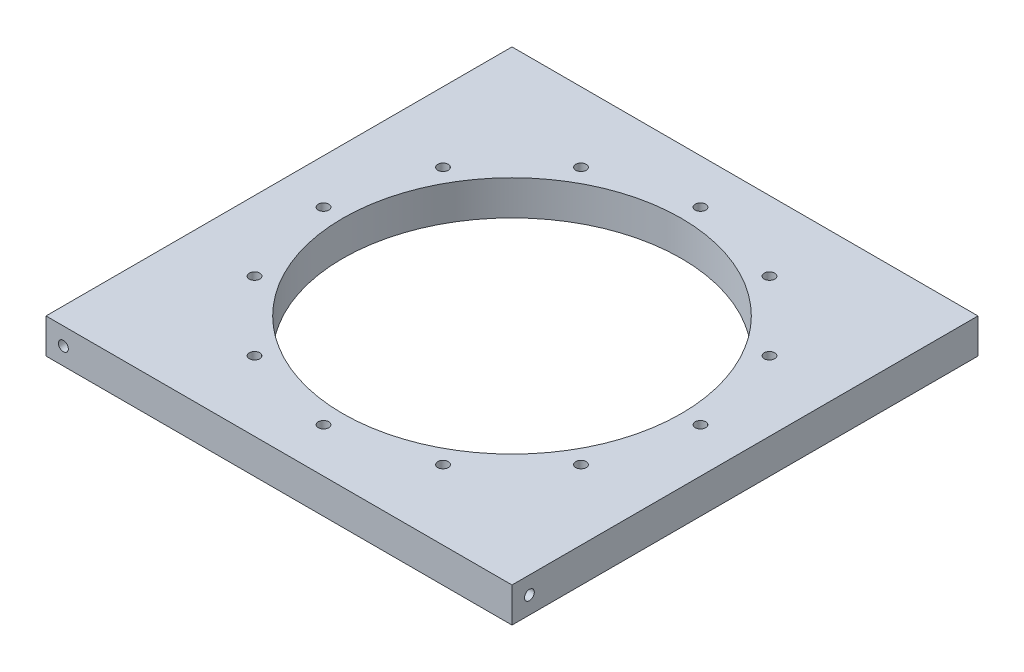
ISO-10303-21;
HEADER;
FILE_DESCRIPTION(('STEP AP214'),'2;1');
FILE_NAME('part.step','',(''),(''),'','','');
FILE_SCHEMA(('AUTOMOTIVE_DESIGN { 1 0 10303 214 1 1 1 1 }'));
ENDSEC;
DATA;
#1=APPLICATION_CONTEXT('core data for automotive mechanical design processes');
#2=APPLICATION_PROTOCOL_DEFINITION('international standard','automotive_design',2000,#1);
#3=PRODUCT_CONTEXT('',#1,'mechanical');
#4=PRODUCT('Part','Part','',(#3));
#5=PRODUCT_RELATED_PRODUCT_CATEGORY('part','',(#4));
#6=PRODUCT_DEFINITION_FORMATION('','',#4);
#7=PRODUCT_DEFINITION_CONTEXT('part definition',#1,'design');
#8=PRODUCT_DEFINITION('design','',#6,#7);
#9=PRODUCT_DEFINITION_SHAPE('','',#8);
#10=(LENGTH_UNIT() NAMED_UNIT(*) SI_UNIT(.MILLI.,.METRE.));
#11=(NAMED_UNIT(*) PLANE_ANGLE_UNIT() SI_UNIT($,.RADIAN.));
#12=(NAMED_UNIT(*) SI_UNIT($,.STERADIAN.) SOLID_ANGLE_UNIT());
#13=UNCERTAINTY_MEASURE_WITH_UNIT(LENGTH_MEASURE(1.E-05),#10,'distance_accuracy_value','');
#14=(GEOMETRIC_REPRESENTATION_CONTEXT(3) GLOBAL_UNCERTAINTY_ASSIGNED_CONTEXT((#13)) GLOBAL_UNIT_ASSIGNED_CONTEXT((#10,
#11,#12)) REPRESENTATION_CONTEXT('',''));
#15=CARTESIAN_POINT('',(0.,0.,0.));
#16=DIRECTION('',(0.,0.,1.));
#17=DIRECTION('',(1.,0.,0.));
#18=AXIS2_PLACEMENT_3D('',#15,#16,#17);
#19=CARTESIAN_POINT('',(0.,9.525,0.));
#20=DIRECTION('',(-1.,0.,0.));
#21=DIRECTION('',(0.,0.,1.));
#22=AXIS2_PLACEMENT_3D('',#19,#20,#21);
#23=PLANE('',#22);
#24=CARTESIAN_POINT('',(0.,4.7625,-122.8725));
#25=DIRECTION('',(-1.,0.,0.));
#26=DIRECTION('',(0.,0.,1.));
#27=AXIS2_PLACEMENT_3D('',#24,#25,#26);
#28=CIRCLE('',#27,1.35255);
#29=CARTESIAN_POINT('',(0.,4.7625,-121.51995));
#30=VERTEX_POINT('',#29);
#31=EDGE_CURVE('E122',#30,#30,#28,.T.);
#32=ORIENTED_EDGE('',*,*,#31,.F.);
#33=EDGE_LOOP('',(#32));
#34=FACE_BOUND('',#33,.T.);
#35=DIRECTION('',(0.,0.,-1.));
#36=VECTOR('',#35,1.);
#37=CARTESIAN_POINT('',(0.,0.,0.));
#38=LINE('',#37,#36);
#39=CARTESIAN_POINT('',(0.,0.,0.));
#40=VERTEX_POINT('',#39);
#41=CARTESIAN_POINT('',(0.,0.,-127.635));
#42=VERTEX_POINT('',#41);
#43=EDGE_CURVE('E102',#40,#42,#38,.T.);
#44=ORIENTED_EDGE('',*,*,#43,.F.);
#45=DIRECTION('',(0.,-1.,0.));
#46=VECTOR('',#45,1.);
#47=CARTESIAN_POINT('',(0.,9.525,0.));
#48=LINE('',#47,#46);
#49=CARTESIAN_POINT('',(0.,9.525,0.));
#50=VERTEX_POINT('',#49);
#51=EDGE_CURVE('E11',#50,#40,#48,.T.);
#52=ORIENTED_EDGE('',*,*,#51,.F.);
#53=DIRECTION('',(0.,0.,-1.));
#54=VECTOR('',#53,1.);
#55=CARTESIAN_POINT('',(0.,9.525,0.));
#56=LINE('',#55,#54);
#57=CARTESIAN_POINT('',(0.,9.525,-127.635));
#58=VERTEX_POINT('',#57);
#59=EDGE_CURVE('E96',#50,#58,#56,.T.);
#60=ORIENTED_EDGE('',*,*,#59,.T.);
#61=DIRECTION('',(0.,-1.,0.));
#62=VECTOR('',#61,1.);
#63=CARTESIAN_POINT('',(0.,9.525,-127.635));
#64=LINE('',#63,#62);
#65=EDGE_CURVE('E39',#58,#42,#64,.T.);
#66=ORIENTED_EDGE('',*,*,#65,.T.);
#67=EDGE_LOOP('',(#44,#52,#60,#66));
#68=FACE_BOUND('',#67,.T.);
#69=ADVANCED_FACE('F36',(#34,#68),#23,.T.);
#70=CARTESIAN_POINT('',(0.,9.525,0.));
#71=DIRECTION('',(0.,0.,-1.));
#72=DIRECTION('',(-1.,0.,0.));
#73=AXIS2_PLACEMENT_3D('',#70,#71,#72);
#74=PLANE('',#73);
#75=CARTESIAN_POINT('',(4.76249999999993,4.7625,0.));
#76=DIRECTION('',(0.,0.,1.));
#77=DIRECTION('',(1.,0.,0.));
#78=AXIS2_PLACEMENT_3D('',#75,#76,#77);
#79=CIRCLE('',#78,1.35255);
#80=CARTESIAN_POINT('',(6.11504999999993,4.7625,0.));
#81=VERTEX_POINT('',#80);
#82=EDGE_CURVE('E131',#81,#81,#79,.T.);
#83=ORIENTED_EDGE('',*,*,#82,.F.);
#84=EDGE_LOOP('',(#83));
#85=FACE_BOUND('',#84,.T.);
#86=DIRECTION('',(1.,0.,0.));
#87=VECTOR('',#86,1.);
#88=CARTESIAN_POINT('',(0.,0.,0.));
#89=LINE('',#88,#87);
#90=CARTESIAN_POINT('',(127.635,0.,0.));
#91=VERTEX_POINT('',#90);
#92=EDGE_CURVE('E69',#40,#91,#89,.T.);
#93=ORIENTED_EDGE('',*,*,#92,.T.);
#94=DIRECTION('',(0.,-1.,0.));
#95=VECTOR('',#94,1.);
#96=CARTESIAN_POINT('',(127.635,9.525,0.));
#97=LINE('',#96,#95);
#98=CARTESIAN_POINT('',(127.635,9.525,0.));
#99=VERTEX_POINT('',#98);
#100=EDGE_CURVE('E45',#99,#91,#97,.T.);
#101=ORIENTED_EDGE('',*,*,#100,.F.);
#102=DIRECTION('',(1.,0.,0.));
#103=VECTOR('',#102,1.);
#104=CARTESIAN_POINT('',(0.,9.525,0.));
#105=LINE('',#104,#103);
#106=EDGE_CURVE('E86',#50,#99,#105,.T.);
#107=ORIENTED_EDGE('',*,*,#106,.F.);
#108=ORIENTED_EDGE('',*,*,#51,.T.);
#109=EDGE_LOOP('',(#93,#101,#107,#108));
#110=FACE_BOUND('',#109,.T.);
#111=ADVANCED_FACE('F113',(#85,#110),#74,.F.);
#112=CARTESIAN_POINT('',(127.635,9.525,0.));
#113=DIRECTION('',(-1.,0.,0.));
#114=DIRECTION('',(0.,0.,1.));
#115=AXIS2_PLACEMENT_3D('',#112,#113,#114);
#116=PLANE('',#115);
#117=CARTESIAN_POINT('',(127.635,4.7625,-4.76250000000004));
#118=DIRECTION('',(1.,0.,0.));
#119=DIRECTION('',(0.,0.,-1.));
#120=AXIS2_PLACEMENT_3D('',#117,#118,#119);
#121=CIRCLE('',#120,1.35255);
#122=CARTESIAN_POINT('',(127.635,4.7625,-6.11505000000004));
#123=VERTEX_POINT('',#122);
#124=EDGE_CURVE('E138',#123,#123,#121,.T.);
#125=ORIENTED_EDGE('',*,*,#124,.F.);
#126=EDGE_LOOP('',(#125));
#127=FACE_BOUND('',#126,.T.);
#128=DIRECTION('',(0.,0.,-1.));
#129=VECTOR('',#128,1.);
#130=CARTESIAN_POINT('',(127.635,0.,0.));
#131=LINE('',#130,#129);
#132=CARTESIAN_POINT('',(127.635,0.,-127.635));
#133=VERTEX_POINT('',#132);
#134=EDGE_CURVE('E93',#91,#133,#131,.T.);
#135=ORIENTED_EDGE('',*,*,#134,.T.);
#136=DIRECTION('',(0.,-1.,0.));
#137=VECTOR('',#136,1.);
#138=CARTESIAN_POINT('',(127.635,9.525,-127.635));
#139=LINE('',#138,#137);
#140=CARTESIAN_POINT('',(127.635,9.525,-127.635));
#141=VERTEX_POINT('',#140);
#142=EDGE_CURVE('E90',#141,#133,#139,.T.);
#143=ORIENTED_EDGE('',*,*,#142,.F.);
#144=DIRECTION('',(0.,0.,-1.));
#145=VECTOR('',#144,1.);
#146=CARTESIAN_POINT('',(127.635,9.525,0.));
#147=LINE('',#146,#145);
#148=EDGE_CURVE('E81',#99,#141,#147,.T.);
#149=ORIENTED_EDGE('',*,*,#148,.F.);
#150=ORIENTED_EDGE('',*,*,#100,.T.);
#151=EDGE_LOOP('',(#135,#143,#149,#150));
#152=FACE_BOUND('',#151,.T.);
#153=ADVANCED_FACE('F91',(#127,#152),#116,.F.);
#154=CARTESIAN_POINT('',(0.,9.525,-127.635));
#155=DIRECTION('',(0.,0.,-1.));
#156=DIRECTION('',(-1.,0.,0.));
#157=AXIS2_PLACEMENT_3D('',#154,#155,#156);
#158=PLANE('',#157);
#159=CARTESIAN_POINT('',(122.8725,4.7625,-127.635));
#160=DIRECTION('',(0.,0.,-1.));
#161=DIRECTION('',(-1.,0.,0.));
#162=AXIS2_PLACEMENT_3D('',#159,#160,#161);
#163=CIRCLE('',#162,1.35255);
#164=CARTESIAN_POINT('',(121.51995,4.7625,-127.635));
#165=VERTEX_POINT('',#164);
#166=EDGE_CURVE('E128',#165,#165,#163,.T.);
#167=ORIENTED_EDGE('',*,*,#166,.F.);
#168=EDGE_LOOP('',(#167));
#169=FACE_BOUND('',#168,.T.);
#170=DIRECTION('',(1.,0.,0.));
#171=VECTOR('',#170,1.);
#172=CARTESIAN_POINT('',(0.,0.,-127.635));
#173=LINE('',#172,#171);
#174=EDGE_CURVE('E105',#42,#133,#173,.T.);
#175=ORIENTED_EDGE('',*,*,#174,.F.);
#176=ORIENTED_EDGE('',*,*,#65,.F.);
#177=DIRECTION('',(1.,0.,0.));
#178=VECTOR('',#177,1.);
#179=CARTESIAN_POINT('',(0.,9.525,-127.635));
#180=LINE('',#179,#178);
#181=EDGE_CURVE('E85',#58,#141,#180,.T.);
#182=ORIENTED_EDGE('',*,*,#181,.T.);
#183=ORIENTED_EDGE('',*,*,#142,.T.);
#184=EDGE_LOOP('',(#175,#176,#182,#183));
#185=FACE_BOUND('',#184,.T.);
#186=ADVANCED_FACE('F95',(#169,#185),#158,.T.);
#187=CARTESIAN_POINT('',(0.,9.525,0.));
#188=DIRECTION('',(0.,-1.,0.));
#189=DIRECTION('',(0.,0.,-1.));
#190=AXIS2_PLACEMENT_3D('',#187,#188,#189);
#191=PLANE('',#190);
#192=CARTESIAN_POINT('',(19.1085055169264,9.525,-89.6302499999999));
#193=DIRECTION('',(0.,1.,0.));
#194=DIRECTION('',(0.86602540378444,0.,0.499999999999998));
#195=AXIS2_PLACEMENT_3D('',#192,#193,#194);
#196=CIRCLE('',#195,1.4351);
#197=CARTESIAN_POINT('',(20.3513385738974,9.525,-88.9126999999999));
#198=VERTEX_POINT('',#197);
#199=EDGE_CURVE('E163',#198,#198,#196,.T.);
#200=ORIENTED_EDGE('',*,*,#199,.F.);
#201=EDGE_LOOP('',(#200));
#202=FACE_BOUND('',#201,.T.);
#203=CARTESIAN_POINT('',(12.192,9.525,-63.8174999999998));
#204=DIRECTION('',(0.,1.,0.));
#205=DIRECTION('',(1.,0.,0.));
#206=AXIS2_PLACEMENT_3D('',#203,#204,#205);
#207=CIRCLE('',#206,1.4351);
#208=CARTESIAN_POINT('',(13.6271,9.525,-63.8174999999998));
#209=VERTEX_POINT('',#208);
#210=EDGE_CURVE('E169',#209,#209,#207,.T.);
#211=ORIENTED_EDGE('',*,*,#210,.F.);
#212=EDGE_LOOP('',(#211));
#213=FACE_BOUND('',#212,.T.);
#214=CARTESIAN_POINT('',(19.1085055169266,9.525,-38.0047499999998));
#215=DIRECTION('',(0.,1.,0.));
#216=DIRECTION('',(0.866025403784436,0.,-0.500000000000004));
#217=AXIS2_PLACEMENT_3D('',#214,#215,#216);
#218=CIRCLE('',#217,1.4351);
#219=CARTESIAN_POINT('',(20.3513385738976,9.525,-38.7222999999998));
#220=VERTEX_POINT('',#219);
#221=EDGE_CURVE('E175',#220,#220,#218,.T.);
#222=ORIENTED_EDGE('',*,*,#221,.F.);
#223=EDGE_LOOP('',(#222));
#224=FACE_BOUND('',#223,.T.);
#225=CARTESIAN_POINT('',(38.0047500000003,9.525,-19.1085055169263));
#226=DIRECTION('',(0.,1.,0.));
#227=DIRECTION('',(0.499999999999995,0.,-0.866025403784442));
#228=AXIS2_PLACEMENT_3D('',#225,#226,#227);
#229=CIRCLE('',#228,1.4351);
#230=CARTESIAN_POINT('',(38.7223000000002,9.525,-20.3513385738974));
#231=VERTEX_POINT('',#230);
#232=EDGE_CURVE('E181',#231,#231,#229,.T.);
#233=ORIENTED_EDGE('',*,*,#232,.F.);
#234=EDGE_LOOP('',(#233));
#235=FACE_BOUND('',#234,.T.);
#236=CARTESIAN_POINT('',(63.8175,9.525,-12.192));
#237=DIRECTION('',(0.,1.,0.));
#238=DIRECTION('',(0.,0.,-1.));
#239=AXIS2_PLACEMENT_3D('',#236,#237,#238);
#240=CIRCLE('',#239,1.4351);
#241=CARTESIAN_POINT('',(63.8175,9.525,-13.6271));
#242=VERTEX_POINT('',#241);
#243=EDGE_CURVE('E187',#242,#242,#240,.T.);
#244=ORIENTED_EDGE('',*,*,#243,.F.);
#245=EDGE_LOOP('',(#244));
#246=FACE_BOUND('',#245,.T.);
#247=CARTESIAN_POINT('',(89.6302500000004,9.525,-19.1085055169267));
#248=DIRECTION('',(0.,1.,0.));
#249=DIRECTION('',(-0.500000000000007,0.,-0.866025403784435));
#250=AXIS2_PLACEMENT_3D('',#247,#248,#249);
#251=CIRCLE('',#250,1.4351);
#252=CARTESIAN_POINT('',(88.9127000000003,9.525,-20.3513385738977));
#253=VERTEX_POINT('',#252);
#254=EDGE_CURVE('E193',#253,#253,#251,.T.);
#255=ORIENTED_EDGE('',*,*,#254,.F.);
#256=EDGE_LOOP('',(#255));
#257=FACE_BOUND('',#256,.T.);
#258=CARTESIAN_POINT('',(108.526494483074,9.525,-38.0047500000004));
#259=DIRECTION('',(0.,1.,0.));
#260=DIRECTION('',(-0.866025403784443,0.,-0.499999999999992));
#261=AXIS2_PLACEMENT_3D('',#258,#259,#260);
#262=CIRCLE('',#261,1.4351);
#263=CARTESIAN_POINT('',(107.283661426103,9.525,-38.7223000000004));
#264=VERTEX_POINT('',#263);
#265=EDGE_CURVE('E199',#264,#264,#262,.T.);
#266=ORIENTED_EDGE('',*,*,#265,.F.);
#267=EDGE_LOOP('',(#266));
#268=FACE_BOUND('',#267,.T.);
#269=CARTESIAN_POINT('',(115.443,9.525,-63.8175000000006));
#270=DIRECTION('',(0.,1.,0.));
#271=DIRECTION('',(-1.,0.,0.));
#272=AXIS2_PLACEMENT_3D('',#269,#270,#271);
#273=CIRCLE('',#272,1.4351);
#274=CARTESIAN_POINT('',(114.0079,9.525,-63.8175000000005));
#275=VERTEX_POINT('',#274);
#276=EDGE_CURVE('E150',#275,#275,#273,.T.);
#277=ORIENTED_EDGE('',*,*,#276,.F.);
#278=EDGE_LOOP('',(#277));
#279=FACE_BOUND('',#278,.T.);
#280=CARTESIAN_POINT('',(108.526494483073,9.525,-89.6302500000005));
#281=DIRECTION('',(0.,1.,0.));
#282=DIRECTION('',(-0.866025403784433,0.,0.50000000000001));
#283=AXIS2_PLACEMENT_3D('',#280,#281,#282);
#284=CIRCLE('',#283,1.4351);
#285=CARTESIAN_POINT('',(107.283661426102,9.525,-88.9127000000005));
#286=VERTEX_POINT('',#285);
#287=EDGE_CURVE('E151',#286,#286,#284,.T.);
#288=ORIENTED_EDGE('',*,*,#287,.F.);
#289=EDGE_LOOP('',(#288));
#290=FACE_BOUND('',#289,.T.);
#291=CARTESIAN_POINT('',(89.6302499999994,9.525,-108.526494483074));
#292=DIRECTION('',(0.,1.,0.));
#293=DIRECTION('',(-0.499999999999989,0.,0.866025403784445));
#294=AXIS2_PLACEMENT_3D('',#291,#292,#293);
#295=CIRCLE('',#294,1.4351);
#296=CARTESIAN_POINT('',(88.9126999999994,9.525,-107.283661426103));
#297=VERTEX_POINT('',#296);
#298=EDGE_CURVE('E144',#297,#297,#295,.T.);
#299=ORIENTED_EDGE('',*,*,#298,.F.);
#300=EDGE_LOOP('',(#299));
#301=FACE_BOUND('',#300,.T.);
#302=CARTESIAN_POINT('',(38.0047499999999,9.525,-108.526494483073));
#303=DIRECTION('',(0.,1.,0.));
#304=DIRECTION('',(0.500000000000001,0.,0.866025403784438));
#305=AXIS2_PLACEMENT_3D('',#302,#303,#304);
#306=CIRCLE('',#305,1.4351);
#307=CARTESIAN_POINT('',(38.7222999999999,9.525,-107.283661426102));
#308=VERTEX_POINT('',#307);
#309=EDGE_CURVE('E162',#308,#308,#306,.T.);
#310=ORIENTED_EDGE('',*,*,#309,.F.);
#311=EDGE_LOOP('',(#310));
#312=FACE_BOUND('',#311,.T.);
#313=CARTESIAN_POINT('',(63.8175,9.525,-115.443));
#314=DIRECTION('',(0.,1.,0.));
#315=DIRECTION('',(0.,0.,1.));
#316=AXIS2_PLACEMENT_3D('',#313,#314,#315);
#317=CIRCLE('',#316,1.4351);
#318=CARTESIAN_POINT('',(63.8175,9.525,-114.0079));
#319=VERTEX_POINT('',#318);
#320=EDGE_CURVE('E210',#319,#319,#317,.T.);
#321=ORIENTED_EDGE('',*,*,#320,.F.);
#322=EDGE_LOOP('',(#321));
#323=FACE_BOUND('',#322,.T.);
#324=CARTESIAN_POINT('',(63.8175,9.525,-63.8175));
#325=DIRECTION('',(0.,1.,0.));
#326=DIRECTION('',(0.,0.,1.));
#327=AXIS2_PLACEMENT_3D('',#324,#325,#326);
#328=CIRCLE('',#327,46.355);
#329=CARTESIAN_POINT('',(63.8175,9.525,-17.4625));
#330=VERTEX_POINT('',#329);
#331=EDGE_CURVE('E216',#330,#330,#328,.T.);
#332=ORIENTED_EDGE('',*,*,#331,.F.);
#333=EDGE_LOOP('',(#332));
#334=FACE_BOUND('',#333,.T.);
#335=ORIENTED_EDGE('',*,*,#59,.F.);
#336=ORIENTED_EDGE('',*,*,#106,.T.);
#337=ORIENTED_EDGE('',*,*,#148,.T.);
#338=ORIENTED_EDGE('',*,*,#181,.F.);
#339=EDGE_LOOP('',(#335,#336,#337,#338));
#340=FACE_BOUND('',#339,.T.);
#341=ADVANCED_FACE('F84',(#202,#213,#224,#235,#246,#257,#268,#279,#290,#301,#312,#323,#334,
#340),#191,.F.);
#342=CARTESIAN_POINT('',(0.,0.,0.));
#343=DIRECTION('',(0.,-1.,0.));
#344=DIRECTION('',(0.,0.,-1.));
#345=AXIS2_PLACEMENT_3D('',#342,#343,#344);
#346=PLANE('',#345);
#347=CARTESIAN_POINT('',(19.1085055169264,0.,-89.6302499999999));
#348=DIRECTION('',(0.,1.,0.));
#349=DIRECTION('',(0.86602540378444,0.,0.499999999999998));
#350=AXIS2_PLACEMENT_3D('',#347,#348,#349);
#351=CIRCLE('',#350,1.4351);
#352=CARTESIAN_POINT('',(20.3513385738974,0.,-88.9126999999999));
#353=VERTEX_POINT('',#352);
#354=EDGE_CURVE('E159',#353,#353,#351,.T.);
#355=ORIENTED_EDGE('',*,*,#354,.T.);
#356=EDGE_LOOP('',(#355));
#357=FACE_BOUND('',#356,.T.);
#358=CARTESIAN_POINT('',(12.192,0.,-63.8174999999998));
#359=DIRECTION('',(0.,1.,0.));
#360=DIRECTION('',(1.,0.,0.));
#361=AXIS2_PLACEMENT_3D('',#358,#359,#360);
#362=CIRCLE('',#361,1.4351);
#363=CARTESIAN_POINT('',(13.6271,0.,-63.8174999999998));
#364=VERTEX_POINT('',#363);
#365=EDGE_CURVE('E166',#364,#364,#362,.T.);
#366=ORIENTED_EDGE('',*,*,#365,.T.);
#367=EDGE_LOOP('',(#366));
#368=FACE_BOUND('',#367,.T.);
#369=CARTESIAN_POINT('',(19.1085055169266,0.,-38.0047499999998));
#370=DIRECTION('',(0.,1.,0.));
#371=DIRECTION('',(0.866025403784436,0.,-0.500000000000004));
#372=AXIS2_PLACEMENT_3D('',#369,#370,#371);
#373=CIRCLE('',#372,1.4351);
#374=CARTESIAN_POINT('',(20.3513385738976,0.,-38.7222999999998));
#375=VERTEX_POINT('',#374);
#376=EDGE_CURVE('E172',#375,#375,#373,.T.);
#377=ORIENTED_EDGE('',*,*,#376,.T.);
#378=EDGE_LOOP('',(#377));
#379=FACE_BOUND('',#378,.T.);
#380=CARTESIAN_POINT('',(38.0047500000003,0.,-19.1085055169263));
#381=DIRECTION('',(0.,1.,0.));
#382=DIRECTION('',(0.499999999999995,0.,-0.866025403784442));
#383=AXIS2_PLACEMENT_3D('',#380,#381,#382);
#384=CIRCLE('',#383,1.4351);
#385=CARTESIAN_POINT('',(38.7223000000002,0.,-20.3513385738974));
#386=VERTEX_POINT('',#385);
#387=EDGE_CURVE('E178',#386,#386,#384,.T.);
#388=ORIENTED_EDGE('',*,*,#387,.T.);
#389=EDGE_LOOP('',(#388));
#390=FACE_BOUND('',#389,.T.);
#391=CARTESIAN_POINT('',(63.8175,0.,-12.192));
#392=DIRECTION('',(0.,1.,0.));
#393=DIRECTION('',(0.,0.,-1.));
#394=AXIS2_PLACEMENT_3D('',#391,#392,#393);
#395=CIRCLE('',#394,1.4351);
#396=CARTESIAN_POINT('',(63.8175,0.,-13.6271));
#397=VERTEX_POINT('',#396);
#398=EDGE_CURVE('E184',#397,#397,#395,.T.);
#399=ORIENTED_EDGE('',*,*,#398,.T.);
#400=EDGE_LOOP('',(#399));
#401=FACE_BOUND('',#400,.T.);
#402=CARTESIAN_POINT('',(89.6302500000004,0.,-19.1085055169267));
#403=DIRECTION('',(0.,1.,0.));
#404=DIRECTION('',(-0.500000000000007,0.,-0.866025403784435));
#405=AXIS2_PLACEMENT_3D('',#402,#403,#404);
#406=CIRCLE('',#405,1.4351);
#407=CARTESIAN_POINT('',(88.9127000000003,0.,-20.3513385738977));
#408=VERTEX_POINT('',#407);
#409=EDGE_CURVE('E190',#408,#408,#406,.T.);
#410=ORIENTED_EDGE('',*,*,#409,.T.);
#411=EDGE_LOOP('',(#410));
#412=FACE_BOUND('',#411,.T.);
#413=CARTESIAN_POINT('',(108.526494483074,0.,-38.0047500000004));
#414=DIRECTION('',(0.,1.,0.));
#415=DIRECTION('',(-0.866025403784443,0.,-0.499999999999992));
#416=AXIS2_PLACEMENT_3D('',#413,#414,#415);
#417=CIRCLE('',#416,1.4351);
#418=CARTESIAN_POINT('',(107.283661426103,0.,-38.7223000000004));
#419=VERTEX_POINT('',#418);
#420=EDGE_CURVE('E196',#419,#419,#417,.T.);
#421=ORIENTED_EDGE('',*,*,#420,.T.);
#422=EDGE_LOOP('',(#421));
#423=FACE_BOUND('',#422,.T.);
#424=CARTESIAN_POINT('',(115.443,0.,-63.8175000000006));
#425=DIRECTION('',(0.,1.,0.));
#426=DIRECTION('',(-1.,0.,0.));
#427=AXIS2_PLACEMENT_3D('',#424,#425,#426);
#428=CIRCLE('',#427,1.4351);
#429=CARTESIAN_POINT('',(114.0079,0.,-63.8175000000005));
#430=VERTEX_POINT('',#429);
#431=EDGE_CURVE('E202',#430,#430,#428,.T.);
#432=ORIENTED_EDGE('',*,*,#431,.T.);
#433=EDGE_LOOP('',(#432));
#434=FACE_BOUND('',#433,.T.);
#435=CARTESIAN_POINT('',(108.526494483073,0.,-89.6302500000005));
#436=DIRECTION('',(0.,1.,0.));
#437=DIRECTION('',(-0.866025403784433,0.,0.50000000000001));
#438=AXIS2_PLACEMENT_3D('',#435,#436,#437);
#439=CIRCLE('',#438,1.4351);
#440=CARTESIAN_POINT('',(107.283661426102,0.,-88.9127000000005));
#441=VERTEX_POINT('',#440);
#442=EDGE_CURVE('E147',#441,#441,#439,.T.);
#443=ORIENTED_EDGE('',*,*,#442,.T.);
#444=EDGE_LOOP('',(#443));
#445=FACE_BOUND('',#444,.T.);
#446=CARTESIAN_POINT('',(89.6302499999994,0.,-108.526494483074));
#447=DIRECTION('',(0.,1.,0.));
#448=DIRECTION('',(-0.499999999999989,0.,0.866025403784445));
#449=AXIS2_PLACEMENT_3D('',#446,#447,#448);
#450=CIRCLE('',#449,1.4351);
#451=CARTESIAN_POINT('',(88.9126999999994,0.,-107.283661426103));
#452=VERTEX_POINT('',#451);
#453=EDGE_CURVE('E154',#452,#452,#450,.T.);
#454=ORIENTED_EDGE('',*,*,#453,.T.);
#455=EDGE_LOOP('',(#454));
#456=FACE_BOUND('',#455,.T.);
#457=CARTESIAN_POINT('',(38.0047499999999,0.,-108.526494483073));
#458=DIRECTION('',(0.,1.,0.));
#459=DIRECTION('',(0.500000000000001,0.,0.866025403784438));
#460=AXIS2_PLACEMENT_3D('',#457,#458,#459);
#461=CIRCLE('',#460,1.4351);
#462=CARTESIAN_POINT('',(38.7222999999999,0.,-107.283661426102));
#463=VERTEX_POINT('',#462);
#464=EDGE_CURVE('E207',#463,#463,#461,.T.);
#465=ORIENTED_EDGE('',*,*,#464,.T.);
#466=EDGE_LOOP('',(#465));
#467=FACE_BOUND('',#466,.T.);
#468=CARTESIAN_POINT('',(63.8175,0.,-115.443));
#469=DIRECTION('',(0.,1.,0.));
#470=DIRECTION('',(0.,0.,1.));
#471=AXIS2_PLACEMENT_3D('',#468,#469,#470);
#472=CIRCLE('',#471,1.4351);
#473=CARTESIAN_POINT('',(63.8175,0.,-114.0079));
#474=VERTEX_POINT('',#473);
#475=EDGE_CURVE('E213',#474,#474,#472,.T.);
#476=ORIENTED_EDGE('',*,*,#475,.T.);
#477=EDGE_LOOP('',(#476));
#478=FACE_BOUND('',#477,.T.);
#479=CARTESIAN_POINT('',(63.8175,0.,-63.8175));
#480=DIRECTION('',(0.,1.,0.));
#481=DIRECTION('',(0.,0.,1.));
#482=AXIS2_PLACEMENT_3D('',#479,#480,#481);
#483=CIRCLE('',#482,46.355);
#484=CARTESIAN_POINT('',(63.8175,0.,-17.4625));
#485=VERTEX_POINT('',#484);
#486=EDGE_CURVE('E106',#485,#485,#483,.T.);
#487=ORIENTED_EDGE('',*,*,#486,.T.);
#488=EDGE_LOOP('',(#487));
#489=FACE_BOUND('',#488,.T.);
#490=ORIENTED_EDGE('',*,*,#43,.T.);
#491=ORIENTED_EDGE('',*,*,#174,.T.);
#492=ORIENTED_EDGE('',*,*,#134,.F.);
#493=ORIENTED_EDGE('',*,*,#92,.F.);
#494=EDGE_LOOP('',(#490,#491,#492,#493));
#495=FACE_BOUND('',#494,.T.);
#496=ADVANCED_FACE('F111',(#357,#368,#379,#390,#401,#412,#423,#434,#445,#456,#467,#478,#489,
#495),#346,.T.);
#497=CARTESIAN_POINT('',(63.8175,0.,-63.8175));
#498=DIRECTION('',(0.,1.,0.));
#499=DIRECTION('',(0.,0.,1.));
#500=AXIS2_PLACEMENT_3D('',#497,#498,#499);
#501=CYLINDRICAL_SURFACE('',#500,46.355);
#502=ORIENTED_EDGE('',*,*,#486,.F.);
#503=EDGE_LOOP('',(#502));
#504=FACE_BOUND('',#503,.T.);
#505=ORIENTED_EDGE('',*,*,#331,.T.);
#506=EDGE_LOOP('',(#505));
#507=FACE_BOUND('',#506,.T.);
#508=ADVANCED_FACE('F223',(#504,#507),#501,.F.);
#509=CARTESIAN_POINT('',(63.8175,0.,-115.443));
#510=DIRECTION('',(0.,1.,0.));
#511=DIRECTION('',(0.,0.,1.));
#512=AXIS2_PLACEMENT_3D('',#509,#510,#511);
#513=CYLINDRICAL_SURFACE('',#512,1.4351);
#514=ORIENTED_EDGE('',*,*,#475,.F.);
#515=EDGE_LOOP('',(#514));
#516=FACE_BOUND('',#515,.T.);
#517=ORIENTED_EDGE('',*,*,#320,.T.);
#518=EDGE_LOOP('',(#517));
#519=FACE_BOUND('',#518,.T.);
#520=ADVANCED_FACE('F303',(#516,#519),#513,.F.);
#521=CARTESIAN_POINT('',(38.0047499999999,0.,-108.526494483073));
#522=DIRECTION('',(0.,1.,0.));
#523=DIRECTION('',(0.,0.,1.));
#524=AXIS2_PLACEMENT_3D('',#521,#522,#523);
#525=CYLINDRICAL_SURFACE('',#524,1.4351);
#526=ORIENTED_EDGE('',*,*,#464,.F.);
#527=EDGE_LOOP('',(#526));
#528=FACE_BOUND('',#527,.T.);
#529=ORIENTED_EDGE('',*,*,#309,.T.);
#530=EDGE_LOOP('',(#529));
#531=FACE_BOUND('',#530,.T.);
#532=ADVANCED_FACE('F273',(#528,#531),#525,.F.);
#533=CARTESIAN_POINT('',(89.6302499999994,0.,-108.526494483074));
#534=DIRECTION('',(0.,1.,0.));
#535=DIRECTION('',(0.,0.,1.));
#536=AXIS2_PLACEMENT_3D('',#533,#534,#535);
#537=CYLINDRICAL_SURFACE('',#536,1.4351);
#538=ORIENTED_EDGE('',*,*,#453,.F.);
#539=EDGE_LOOP('',(#538));
#540=FACE_BOUND('',#539,.T.);
#541=ORIENTED_EDGE('',*,*,#298,.T.);
#542=EDGE_LOOP('',(#541));
#543=FACE_BOUND('',#542,.T.);
#544=ADVANCED_FACE('F270',(#540,#543),#537,.F.);
#545=CARTESIAN_POINT('',(108.526494483073,0.,-89.6302500000005));
#546=DIRECTION('',(0.,1.,0.));
#547=DIRECTION('',(0.,0.,1.));
#548=AXIS2_PLACEMENT_3D('',#545,#546,#547);
#549=CYLINDRICAL_SURFACE('',#548,1.4351);
#550=ORIENTED_EDGE('',*,*,#442,.F.);
#551=EDGE_LOOP('',(#550));
#552=FACE_BOUND('',#551,.T.);
#553=ORIENTED_EDGE('',*,*,#287,.T.);
#554=EDGE_LOOP('',(#553));
#555=FACE_BOUND('',#554,.T.);
#556=ADVANCED_FACE('F266',(#552,#555),#549,.F.);
#557=CARTESIAN_POINT('',(115.443,0.,-63.8175000000006));
#558=DIRECTION('',(0.,1.,0.));
#559=DIRECTION('',(0.,0.,1.));
#560=AXIS2_PLACEMENT_3D('',#557,#558,#559);
#561=CYLINDRICAL_SURFACE('',#560,1.4351);
#562=ORIENTED_EDGE('',*,*,#431,.F.);
#563=EDGE_LOOP('',(#562));
#564=FACE_BOUND('',#563,.T.);
#565=ORIENTED_EDGE('',*,*,#276,.T.);
#566=EDGE_LOOP('',(#565));
#567=FACE_BOUND('',#566,.T.);
#568=ADVANCED_FACE('F269',(#564,#567),#561,.F.);
#569=CARTESIAN_POINT('',(108.526494483074,0.,-38.0047500000004));
#570=DIRECTION('',(0.,1.,0.));
#571=DIRECTION('',(0.,0.,1.));
#572=AXIS2_PLACEMENT_3D('',#569,#570,#571);
#573=CYLINDRICAL_SURFACE('',#572,1.4351);
#574=ORIENTED_EDGE('',*,*,#420,.F.);
#575=EDGE_LOOP('',(#574));
#576=FACE_BOUND('',#575,.T.);
#577=ORIENTED_EDGE('',*,*,#265,.T.);
#578=EDGE_LOOP('',(#577));
#579=FACE_BOUND('',#578,.T.);
#580=ADVANCED_FACE('F294',(#576,#579),#573,.F.);
#581=CARTESIAN_POINT('',(89.6302500000004,0.,-19.1085055169267));
#582=DIRECTION('',(0.,1.,0.));
#583=DIRECTION('',(0.,0.,1.));
#584=AXIS2_PLACEMENT_3D('',#581,#582,#583);
#585=CYLINDRICAL_SURFACE('',#584,1.4351);
#586=ORIENTED_EDGE('',*,*,#409,.F.);
#587=EDGE_LOOP('',(#586));
#588=FACE_BOUND('',#587,.T.);
#589=ORIENTED_EDGE('',*,*,#254,.T.);
#590=EDGE_LOOP('',(#589));
#591=FACE_BOUND('',#590,.T.);
#592=ADVANCED_FACE('F290',(#588,#591),#585,.F.);
#593=CARTESIAN_POINT('',(63.8175,0.,-12.192));
#594=DIRECTION('',(0.,1.,0.));
#595=DIRECTION('',(0.,0.,1.));
#596=AXIS2_PLACEMENT_3D('',#593,#594,#595);
#597=CYLINDRICAL_SURFACE('',#596,1.4351);
#598=ORIENTED_EDGE('',*,*,#398,.F.);
#599=EDGE_LOOP('',(#598));
#600=FACE_BOUND('',#599,.T.);
#601=ORIENTED_EDGE('',*,*,#243,.T.);
#602=EDGE_LOOP('',(#601));
#603=FACE_BOUND('',#602,.T.);
#604=ADVANCED_FACE('F286',(#600,#603),#597,.F.);
#605=CARTESIAN_POINT('',(38.0047500000003,0.,-19.1085055169263));
#606=DIRECTION('',(0.,1.,0.));
#607=DIRECTION('',(0.,0.,1.));
#608=AXIS2_PLACEMENT_3D('',#605,#606,#607);
#609=CYLINDRICAL_SURFACE('',#608,1.4351);
#610=ORIENTED_EDGE('',*,*,#387,.F.);
#611=EDGE_LOOP('',(#610));
#612=FACE_BOUND('',#611,.T.);
#613=ORIENTED_EDGE('',*,*,#232,.T.);
#614=EDGE_LOOP('',(#613));
#615=FACE_BOUND('',#614,.T.);
#616=ADVANCED_FACE('F282',(#612,#615),#609,.F.);
#617=CARTESIAN_POINT('',(19.1085055169266,0.,-38.0047499999998));
#618=DIRECTION('',(0.,1.,0.));
#619=DIRECTION('',(0.,0.,1.));
#620=AXIS2_PLACEMENT_3D('',#617,#618,#619);
#621=CYLINDRICAL_SURFACE('',#620,1.4351);
#622=ORIENTED_EDGE('',*,*,#376,.F.);
#623=EDGE_LOOP('',(#622));
#624=FACE_BOUND('',#623,.T.);
#625=ORIENTED_EDGE('',*,*,#221,.T.);
#626=EDGE_LOOP('',(#625));
#627=FACE_BOUND('',#626,.T.);
#628=ADVANCED_FACE('F278',(#624,#627),#621,.F.);
#629=CARTESIAN_POINT('',(12.192,0.,-63.8174999999998));
#630=DIRECTION('',(0.,1.,0.));
#631=DIRECTION('',(0.,0.,1.));
#632=AXIS2_PLACEMENT_3D('',#629,#630,#631);
#633=CYLINDRICAL_SURFACE('',#632,1.4351);
#634=ORIENTED_EDGE('',*,*,#365,.F.);
#635=EDGE_LOOP('',(#634));
#636=FACE_BOUND('',#635,.T.);
#637=ORIENTED_EDGE('',*,*,#210,.T.);
#638=EDGE_LOOP('',(#637));
#639=FACE_BOUND('',#638,.T.);
#640=ADVANCED_FACE('F260',(#636,#639),#633,.F.);
#641=CARTESIAN_POINT('',(19.1085055169264,0.,-89.6302499999999));
#642=DIRECTION('',(0.,1.,0.));
#643=DIRECTION('',(0.,0.,1.));
#644=AXIS2_PLACEMENT_3D('',#641,#642,#643);
#645=CYLINDRICAL_SURFACE('',#644,1.4351);
#646=ORIENTED_EDGE('',*,*,#354,.F.);
#647=EDGE_LOOP('',(#646));
#648=FACE_BOUND('',#647,.T.);
#649=ORIENTED_EDGE('',*,*,#199,.T.);
#650=EDGE_LOOP('',(#649));
#651=FACE_BOUND('',#650,.T.);
#652=ADVANCED_FACE('F249',(#648,#651),#645,.F.);
#653=CARTESIAN_POINT('',(114.935,4.7625,-4.76250000000004));
#654=DIRECTION('',(1.,0.,0.));
#655=DIRECTION('',(0.,0.,-1.));
#656=AXIS2_PLACEMENT_3D('',#653,#654,#655);
#657=CYLINDRICAL_SURFACE('',#656,1.35255);
#658=CARTESIAN_POINT('',(114.935,4.7625,-4.76250000000004));
#659=DIRECTION('',(1.,0.,0.));
#660=DIRECTION('',(0.,0.,-1.));
#661=AXIS2_PLACEMENT_3D('',#658,#659,#660);
#662=CIRCLE('',#661,1.35255);
#663=CARTESIAN_POINT('',(114.935,4.7625,-6.11505000000004));
#664=VERTEX_POINT('',#663);
#665=EDGE_CURVE('E141',#664,#664,#662,.T.);
#666=ORIENTED_EDGE('',*,*,#665,.F.);
#667=EDGE_LOOP('',(#666));
#668=FACE_BOUND('',#667,.T.);
#669=ORIENTED_EDGE('',*,*,#124,.T.);
#670=EDGE_LOOP('',(#669));
#671=FACE_BOUND('',#670,.T.);
#672=ADVANCED_FACE('F246',(#668,#671),#657,.F.);
#673=CARTESIAN_POINT('',(114.935,4.7625,-4.76250000000004));
#674=DIRECTION('',(1.,0.,0.));
#675=DIRECTION('',(0.,0.,-1.));
#676=AXIS2_PLACEMENT_3D('',#673,#674,#675);
#677=PLANE('',#676);
#678=ORIENTED_EDGE('',*,*,#665,.T.);
#679=EDGE_LOOP('',(#678));
#680=FACE_BOUND('',#679,.T.);
#681=ADVANCED_FACE('F248',(#680),#677,.T.);
#682=CARTESIAN_POINT('',(122.8725,4.7625,-114.935));
#683=DIRECTION('',(0.,0.,-1.));
#684=DIRECTION('',(-1.,0.,0.));
#685=AXIS2_PLACEMENT_3D('',#682,#683,#684);
#686=CYLINDRICAL_SURFACE('',#685,1.35255);
#687=CARTESIAN_POINT('',(122.8725,4.7625,-114.935));
#688=DIRECTION('',(0.,0.,-1.));
#689=DIRECTION('',(-1.,0.,0.));
#690=AXIS2_PLACEMENT_3D('',#687,#688,#689);
#691=CIRCLE('',#690,1.35255);
#692=CARTESIAN_POINT('',(121.51995,4.7625,-114.935));
#693=VERTEX_POINT('',#692);
#694=EDGE_CURVE('E135',#693,#693,#691,.T.);
#695=ORIENTED_EDGE('',*,*,#694,.F.);
#696=EDGE_LOOP('',(#695));
#697=FACE_BOUND('',#696,.T.);
#698=ORIENTED_EDGE('',*,*,#166,.T.);
#699=EDGE_LOOP('',(#698));
#700=FACE_BOUND('',#699,.T.);
#701=ADVANCED_FACE('F256',(#697,#700),#686,.F.);
#702=CARTESIAN_POINT('',(122.8725,4.7625,-114.935));
#703=DIRECTION('',(0.,0.,-1.));
#704=DIRECTION('',(-1.,0.,0.));
#705=AXIS2_PLACEMENT_3D('',#702,#703,#704);
#706=PLANE('',#705);
#707=ORIENTED_EDGE('',*,*,#694,.T.);
#708=EDGE_LOOP('',(#707));
#709=FACE_BOUND('',#708,.T.);
#710=ADVANCED_FACE('F433',(#709),#706,.T.);
#711=CARTESIAN_POINT('',(12.7,4.7625,-122.8725));
#712=DIRECTION('',(-1.,0.,0.));
#713=DIRECTION('',(0.,0.,1.));
#714=AXIS2_PLACEMENT_3D('',#711,#712,#713);
#715=CYLINDRICAL_SURFACE('',#714,1.35255);
#716=CARTESIAN_POINT('',(12.7,4.7625,-122.8725));
#717=DIRECTION('',(-1.,0.,0.));
#718=DIRECTION('',(0.,0.,1.));
#719=AXIS2_PLACEMENT_3D('',#716,#717,#718);
#720=CIRCLE('',#719,1.35255);
#721=CARTESIAN_POINT('',(12.7,4.7625,-121.51995));
#722=VERTEX_POINT('',#721);
#723=EDGE_CURVE('E124',#722,#722,#720,.T.);
#724=ORIENTED_EDGE('',*,*,#723,.F.);
#725=EDGE_LOOP('',(#724));
#726=FACE_BOUND('',#725,.T.);
#727=ORIENTED_EDGE('',*,*,#31,.T.);
#728=EDGE_LOOP('',(#727));
#729=FACE_BOUND('',#728,.T.);
#730=ADVANCED_FACE('F441',(#726,#729),#715,.F.);
#731=CARTESIAN_POINT('',(12.7,4.7625,-122.8725));
#732=DIRECTION('',(-1.,0.,0.));
#733=DIRECTION('',(0.,0.,1.));
#734=AXIS2_PLACEMENT_3D('',#731,#732,#733);
#735=PLANE('',#734);
#736=ORIENTED_EDGE('',*,*,#723,.T.);
#737=EDGE_LOOP('',(#736));
#738=FACE_BOUND('',#737,.T.);
#739=ADVANCED_FACE('F456',(#738),#735,.T.);
#740=CARTESIAN_POINT('',(4.76249999999993,4.7625,-12.7));
#741=DIRECTION('',(0.,0.,1.));
#742=DIRECTION('',(1.,0.,0.));
#743=AXIS2_PLACEMENT_3D('',#740,#741,#742);
#744=CYLINDRICAL_SURFACE('',#743,1.35255);
#745=CARTESIAN_POINT('',(4.76249999999993,4.7625,-12.7));
#746=DIRECTION('',(0.,0.,1.));
#747=DIRECTION('',(1.,0.,0.));
#748=AXIS2_PLACEMENT_3D('',#745,#746,#747);
#749=CIRCLE('',#748,1.35255);
#750=CARTESIAN_POINT('',(6.11504999999993,4.7625,-12.7));
#751=VERTEX_POINT('',#750);
#752=EDGE_CURVE('E125',#751,#751,#749,.T.);
#753=ORIENTED_EDGE('',*,*,#752,.F.);
#754=EDGE_LOOP('',(#753));
#755=FACE_BOUND('',#754,.T.);
#756=ORIENTED_EDGE('',*,*,#82,.T.);
#757=EDGE_LOOP('',(#756));
#758=FACE_BOUND('',#757,.T.);
#759=ADVANCED_FACE('F466',(#755,#758),#744,.F.);
#760=CARTESIAN_POINT('',(4.76249999999993,4.7625,-12.7));
#761=DIRECTION('',(0.,0.,1.));
#762=DIRECTION('',(1.,0.,0.));
#763=AXIS2_PLACEMENT_3D('',#760,#761,#762);
#764=PLANE('',#763);
#765=ORIENTED_EDGE('',*,*,#752,.T.);
#766=EDGE_LOOP('',(#765));
#767=FACE_BOUND('',#766,.T.);
#768=ADVANCED_FACE('F481',(#767),#764,.T.);
#769=CLOSED_SHELL('',(#69,#111,#153,#186,#341,#496,#508,#520,#532,#544,#556,#568,#580,#592,#604,
#616,#628,#640,#652,#672,#681,#701,#710,#730,#739,#759,#768));
#770=MANIFOLD_SOLID_BREP('B2',#769);
#771=ADVANCED_BREP_SHAPE_REPRESENTATION('',(#18,#770),#14);
#772=SHAPE_DEFINITION_REPRESENTATION(#9,#771);
ENDSEC;
END-ISO-10303-21;
